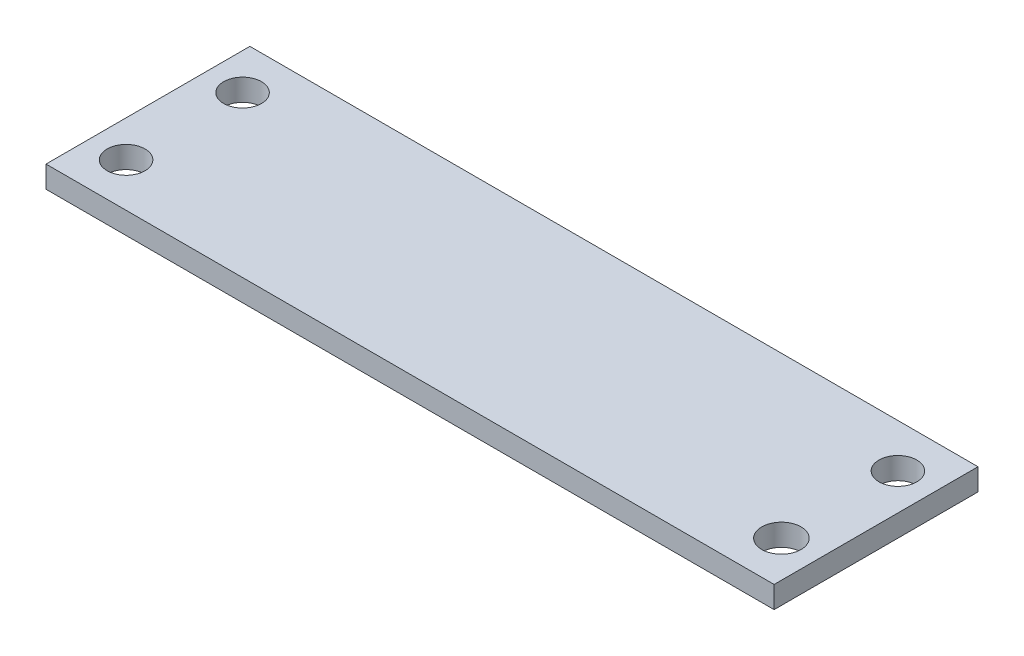
ISO-10303-21;
HEADER;
FILE_DESCRIPTION(('STEP AP214'),'2;1');
FILE_NAME('part.step','',(''),(''),'','','');
FILE_SCHEMA(('AUTOMOTIVE_DESIGN { 1 0 10303 214 1 1 1 1 }'));
ENDSEC;
DATA;
#1=APPLICATION_CONTEXT('core data for automotive mechanical design processes');
#2=APPLICATION_PROTOCOL_DEFINITION('international standard','automotive_design',2000,#1);
#3=PRODUCT_CONTEXT('',#1,'mechanical');
#4=PRODUCT('Part','Part','',(#3));
#5=PRODUCT_RELATED_PRODUCT_CATEGORY('part','',(#4));
#6=PRODUCT_DEFINITION_FORMATION('','',#4);
#7=PRODUCT_DEFINITION_CONTEXT('part definition',#1,'design');
#8=PRODUCT_DEFINITION('design','',#6,#7);
#9=PRODUCT_DEFINITION_SHAPE('','',#8);
#10=(LENGTH_UNIT() NAMED_UNIT(*) SI_UNIT(.MILLI.,.METRE.));
#11=(NAMED_UNIT(*) PLANE_ANGLE_UNIT() SI_UNIT($,.RADIAN.));
#12=(NAMED_UNIT(*) SI_UNIT($,.STERADIAN.) SOLID_ANGLE_UNIT());
#13=UNCERTAINTY_MEASURE_WITH_UNIT(LENGTH_MEASURE(1.E-05),#10,'distance_accuracy_value','');
#14=(GEOMETRIC_REPRESENTATION_CONTEXT(3) GLOBAL_UNCERTAINTY_ASSIGNED_CONTEXT((#13)) GLOBAL_UNIT_ASSIGNED_CONTEXT((#10,
#11,#12)) REPRESENTATION_CONTEXT('',''));
#15=CARTESIAN_POINT('',(0.,0.,0.));
#16=DIRECTION('',(0.,0.,1.));
#17=DIRECTION('',(1.,0.,0.));
#18=AXIS2_PLACEMENT_3D('',#15,#16,#17);
#19=CARTESIAN_POINT('',(0.,1.5,0.));
#20=DIRECTION('',(0.,-1.,0.));
#21=DIRECTION('',(0.,0.,-1.));
#22=AXIS2_PLACEMENT_3D('',#19,#20,#21);
#23=PLANE('',#22);
#24=DIRECTION('',(0.,0.,-1.));
#25=VECTOR('',#24,1.);
#26=CARTESIAN_POINT('',(25.,1.5,-11.));
#27=LINE('',#26,#25);
#28=CARTESIAN_POINT('',(25.,1.5,3.));
#29=VERTEX_POINT('',#28);
#30=CARTESIAN_POINT('',(25.,1.5,-11.));
#31=VERTEX_POINT('',#30);
#32=EDGE_CURVE('E87',#29,#31,#27,.T.);
#33=ORIENTED_EDGE('',*,*,#32,.T.);
#34=DIRECTION('',(-1.,0.,0.));
#35=VECTOR('',#34,1.);
#36=CARTESIAN_POINT('',(0.,1.5,-11.));
#37=LINE('',#36,#35);
#38=CARTESIAN_POINT('',(-25.,1.5,-11.));
#39=VERTEX_POINT('',#38);
#40=EDGE_CURVE('E82',#31,#39,#37,.T.);
#41=ORIENTED_EDGE('',*,*,#40,.T.);
#42=DIRECTION('',(0.,0.,1.));
#43=VECTOR('',#42,1.);
#44=CARTESIAN_POINT('',(-25.,1.5,3.00000000000001));
#45=LINE('',#44,#43);
#46=CARTESIAN_POINT('',(-25.,1.5,3.00000000000001));
#47=VERTEX_POINT('',#46);
#48=EDGE_CURVE('E85',#39,#47,#45,.T.);
#49=ORIENTED_EDGE('',*,*,#48,.T.);
#50=DIRECTION('',(1.,0.,0.));
#51=VECTOR('',#50,1.);
#52=CARTESIAN_POINT('',(25.,1.5,3.));
#53=LINE('',#52,#51);
#54=EDGE_CURVE('E52',#47,#29,#53,.T.);
#55=ORIENTED_EDGE('',*,*,#54,.T.);
#56=EDGE_LOOP('',(#33,#41,#49,#55));
#57=FACE_BOUND('',#56,.T.);
#58=CARTESIAN_POINT('',(22.5,1.5,0.));
#59=DIRECTION('',(0.,1.,0.));
#60=DIRECTION('',(0.,0.,1.));
#61=AXIS2_PLACEMENT_3D('',#58,#59,#60);
#62=CIRCLE('',#61,1.35);
#63=CARTESIAN_POINT('',(22.5,1.5,1.35));
#64=VERTEX_POINT('',#63);
#65=EDGE_CURVE('E102',#64,#64,#62,.T.);
#66=ORIENTED_EDGE('',*,*,#65,.F.);
#67=EDGE_LOOP('',(#66));
#68=FACE_BOUND('',#67,.T.);
#69=CARTESIAN_POINT('',(-22.5,1.5,0.));
#70=DIRECTION('',(0.,1.,0.));
#71=DIRECTION('',(0.,0.,1.));
#72=AXIS2_PLACEMENT_3D('',#69,#70,#71);
#73=CIRCLE('',#72,1.3);
#74=CARTESIAN_POINT('',(-22.5,1.5,1.3));
#75=VERTEX_POINT('',#74);
#76=EDGE_CURVE('E117',#75,#75,#73,.T.);
#77=ORIENTED_EDGE('',*,*,#76,.F.);
#78=EDGE_LOOP('',(#77));
#79=FACE_BOUND('',#78,.T.);
#80=CARTESIAN_POINT('',(-22.5,1.5,-8.));
#81=DIRECTION('',(0.,1.,0.));
#82=DIRECTION('',(0.,0.,1.));
#83=AXIS2_PLACEMENT_3D('',#80,#81,#82);
#84=CIRCLE('',#83,1.3);
#85=CARTESIAN_POINT('',(-22.5,1.5,-6.7));
#86=VERTEX_POINT('',#85);
#87=EDGE_CURVE('E123',#86,#86,#84,.T.);
#88=ORIENTED_EDGE('',*,*,#87,.F.);
#89=EDGE_LOOP('',(#88));
#90=FACE_BOUND('',#89,.T.);
#91=CARTESIAN_POINT('',(22.5,1.5,-8.));
#92=DIRECTION('',(0.,1.,0.));
#93=DIRECTION('',(0.,0.,1.));
#94=AXIS2_PLACEMENT_3D('',#91,#92,#93);
#95=CIRCLE('',#94,1.3);
#96=CARTESIAN_POINT('',(22.5,1.5,-6.7));
#97=VERTEX_POINT('',#96);
#98=EDGE_CURVE('E129',#97,#97,#95,.T.);
#99=ORIENTED_EDGE('',*,*,#98,.F.);
#100=EDGE_LOOP('',(#99));
#101=FACE_BOUND('',#100,.T.);
#102=ADVANCED_FACE('F35',(#57,#68,#79,#90,#101),#23,.F.);
#103=CARTESIAN_POINT('',(0.,0.,0.));
#104=DIRECTION('',(0.,-1.,0.));
#105=DIRECTION('',(0.,0.,-1.));
#106=AXIS2_PLACEMENT_3D('',#103,#104,#105);
#107=PLANE('',#106);
#108=CARTESIAN_POINT('',(-22.5,0.,-8.));
#109=DIRECTION('',(0.,1.,0.));
#110=DIRECTION('',(0.,0.,1.));
#111=AXIS2_PLACEMENT_3D('',#108,#109,#110);
#112=CIRCLE('',#111,1.3);
#113=CARTESIAN_POINT('',(-22.5,0.,-6.7));
#114=VERTEX_POINT('',#113);
#115=EDGE_CURVE('E126',#114,#114,#112,.T.);
#116=ORIENTED_EDGE('',*,*,#115,.T.);
#117=EDGE_LOOP('',(#116));
#118=FACE_BOUND('',#117,.T.);
#119=CARTESIAN_POINT('',(22.5,0.,0.));
#120=DIRECTION('',(0.,1.,0.));
#121=DIRECTION('',(0.,0.,1.));
#122=AXIS2_PLACEMENT_3D('',#119,#120,#121);
#123=CIRCLE('',#122,1.35);
#124=CARTESIAN_POINT('',(22.5,0.,1.35));
#125=VERTEX_POINT('',#124);
#126=EDGE_CURVE('E114',#125,#125,#123,.T.);
#127=ORIENTED_EDGE('',*,*,#126,.T.);
#128=EDGE_LOOP('',(#127));
#129=FACE_BOUND('',#128,.T.);
#130=DIRECTION('',(0.,0.,-1.));
#131=VECTOR('',#130,1.);
#132=CARTESIAN_POINT('',(25.,0.,-11.));
#133=LINE('',#132,#131);
#134=CARTESIAN_POINT('',(25.,0.,3.));
#135=VERTEX_POINT('',#134);
#136=CARTESIAN_POINT('',(25.,0.,-11.));
#137=VERTEX_POINT('',#136);
#138=EDGE_CURVE('E99',#135,#137,#133,.T.);
#139=ORIENTED_EDGE('',*,*,#138,.F.);
#140=DIRECTION('',(1.,0.,0.));
#141=VECTOR('',#140,1.);
#142=CARTESIAN_POINT('',(25.,0.,3.));
#143=LINE('',#142,#141);
#144=CARTESIAN_POINT('',(-25.,0.,3.00000000000001));
#145=VERTEX_POINT('',#144);
#146=EDGE_CURVE('E75',#145,#135,#143,.T.);
#147=ORIENTED_EDGE('',*,*,#146,.F.);
#148=DIRECTION('',(0.,0.,1.));
#149=VECTOR('',#148,1.);
#150=CARTESIAN_POINT('',(-25.,0.,3.00000000000001));
#151=LINE('',#150,#149);
#152=CARTESIAN_POINT('',(-25.,0.,-11.));
#153=VERTEX_POINT('',#152);
#154=EDGE_CURVE('E69',#153,#145,#151,.T.);
#155=ORIENTED_EDGE('',*,*,#154,.F.);
#156=DIRECTION('',(-1.,0.,0.));
#157=VECTOR('',#156,1.);
#158=CARTESIAN_POINT('',(-25.,0.,-11.));
#159=LINE('',#158,#157);
#160=EDGE_CURVE('E91',#137,#153,#159,.T.);
#161=ORIENTED_EDGE('',*,*,#160,.F.);
#162=EDGE_LOOP('',(#139,#147,#155,#161));
#163=FACE_BOUND('',#162,.T.);
#164=CARTESIAN_POINT('',(-22.5,0.,0.));
#165=DIRECTION('',(0.,1.,0.));
#166=DIRECTION('',(0.,0.,1.));
#167=AXIS2_PLACEMENT_3D('',#164,#165,#166);
#168=CIRCLE('',#167,1.3);
#169=CARTESIAN_POINT('',(-22.5,0.,1.3));
#170=VERTEX_POINT('',#169);
#171=EDGE_CURVE('E120',#170,#170,#168,.T.);
#172=ORIENTED_EDGE('',*,*,#171,.T.);
#173=EDGE_LOOP('',(#172));
#174=FACE_BOUND('',#173,.T.);
#175=CARTESIAN_POINT('',(22.5,0.,-8.));
#176=DIRECTION('',(0.,1.,0.));
#177=DIRECTION('',(0.,0.,1.));
#178=AXIS2_PLACEMENT_3D('',#175,#176,#177);
#179=CIRCLE('',#178,1.3);
#180=CARTESIAN_POINT('',(22.5,0.,-6.7));
#181=VERTEX_POINT('',#180);
#182=EDGE_CURVE('E132',#181,#181,#179,.T.);
#183=ORIENTED_EDGE('',*,*,#182,.T.);
#184=EDGE_LOOP('',(#183));
#185=FACE_BOUND('',#184,.T.);
#186=ADVANCED_FACE('F110',(#118,#129,#163,#174,#185),#107,.T.);
#187=CARTESIAN_POINT('',(25.,1.5,-11.));
#188=DIRECTION('',(-1.,0.,0.));
#189=DIRECTION('',(0.,0.,1.));
#190=AXIS2_PLACEMENT_3D('',#187,#188,#189);
#191=PLANE('',#190);
#192=ORIENTED_EDGE('',*,*,#138,.T.);
#193=DIRECTION('',(0.,-1.,0.));
#194=VECTOR('',#193,1.);
#195=CARTESIAN_POINT('',(25.,1.5,-11.));
#196=LINE('',#195,#194);
#197=EDGE_CURVE('E11',#31,#137,#196,.T.);
#198=ORIENTED_EDGE('',*,*,#197,.F.);
#199=ORIENTED_EDGE('',*,*,#32,.F.);
#200=DIRECTION('',(0.,-1.,0.));
#201=VECTOR('',#200,1.);
#202=CARTESIAN_POINT('',(25.,1.5,3.));
#203=LINE('',#202,#201);
#204=EDGE_CURVE('E95',#29,#135,#203,.T.);
#205=ORIENTED_EDGE('',*,*,#204,.T.);
#206=EDGE_LOOP('',(#192,#198,#199,#205));
#207=FACE_BOUND('',#206,.T.);
#208=ADVANCED_FACE('F37',(#207),#191,.F.);
#209=CARTESIAN_POINT('',(-25.,1.5,-11.));
#210=DIRECTION('',(0.,0.,1.));
#211=DIRECTION('',(1.,0.,0.));
#212=AXIS2_PLACEMENT_3D('',#209,#210,#211);
#213=PLANE('',#212);
#214=ORIENTED_EDGE('',*,*,#160,.T.);
#215=DIRECTION('',(0.,-1.,0.));
#216=VECTOR('',#215,1.);
#217=CARTESIAN_POINT('',(-25.,1.5,-11.));
#218=LINE('',#217,#216);
#219=EDGE_CURVE('E44',#39,#153,#218,.T.);
#220=ORIENTED_EDGE('',*,*,#219,.F.);
#221=ORIENTED_EDGE('',*,*,#40,.F.);
#222=ORIENTED_EDGE('',*,*,#197,.T.);
#223=EDGE_LOOP('',(#214,#220,#221,#222));
#224=FACE_BOUND('',#223,.T.);
#225=ADVANCED_FACE('F90',(#224),#213,.F.);
#226=CARTESIAN_POINT('',(-25.,1.5,3.00000000000001));
#227=DIRECTION('',(1.,0.,0.));
#228=DIRECTION('',(0.,0.,-1.));
#229=AXIS2_PLACEMENT_3D('',#226,#227,#228);
#230=PLANE('',#229);
#231=ORIENTED_EDGE('',*,*,#154,.T.);
#232=DIRECTION('',(0.,-1.,0.));
#233=VECTOR('',#232,1.);
#234=CARTESIAN_POINT('',(-25.,1.5,3.00000000000001));
#235=LINE('',#234,#233);
#236=EDGE_CURVE('E92',#47,#145,#235,.T.);
#237=ORIENTED_EDGE('',*,*,#236,.F.);
#238=ORIENTED_EDGE('',*,*,#48,.F.);
#239=ORIENTED_EDGE('',*,*,#219,.T.);
#240=EDGE_LOOP('',(#231,#237,#238,#239));
#241=FACE_BOUND('',#240,.T.);
#242=ADVANCED_FACE('F93',(#241),#230,.F.);
#243=CARTESIAN_POINT('',(25.,1.5,3.));
#244=DIRECTION('',(0.,0.,-1.));
#245=DIRECTION('',(-1.,0.,0.));
#246=AXIS2_PLACEMENT_3D('',#243,#244,#245);
#247=PLANE('',#246);
#248=ORIENTED_EDGE('',*,*,#146,.T.);
#249=ORIENTED_EDGE('',*,*,#204,.F.);
#250=ORIENTED_EDGE('',*,*,#54,.F.);
#251=ORIENTED_EDGE('',*,*,#236,.T.);
#252=EDGE_LOOP('',(#248,#249,#250,#251));
#253=FACE_BOUND('',#252,.T.);
#254=ADVANCED_FACE('F107',(#253),#247,.F.);
#255=CARTESIAN_POINT('',(22.5,1.5,0.));
#256=DIRECTION('',(0.,-1.,0.));
#257=DIRECTION('',(0.,0.,-1.));
#258=AXIS2_PLACEMENT_3D('',#255,#256,#257);
#259=CYLINDRICAL_SURFACE('',#258,1.35);
#260=ORIENTED_EDGE('',*,*,#65,.T.);
#261=EDGE_LOOP('',(#260));
#262=FACE_BOUND('',#261,.T.);
#263=ORIENTED_EDGE('',*,*,#126,.F.);
#264=EDGE_LOOP('',(#263));
#265=FACE_BOUND('',#264,.T.);
#266=ADVANCED_FACE('F149',(#262,#265),#259,.F.);
#267=CARTESIAN_POINT('',(-22.5,1.5,0.));
#268=DIRECTION('',(0.,-1.,0.));
#269=DIRECTION('',(0.,0.,-1.));
#270=AXIS2_PLACEMENT_3D('',#267,#268,#269);
#271=CYLINDRICAL_SURFACE('',#270,1.3);
#272=ORIENTED_EDGE('',*,*,#76,.T.);
#273=EDGE_LOOP('',(#272));
#274=FACE_BOUND('',#273,.T.);
#275=ORIENTED_EDGE('',*,*,#171,.F.);
#276=EDGE_LOOP('',(#275));
#277=FACE_BOUND('',#276,.T.);
#278=ADVANCED_FACE('F198',(#274,#277),#271,.F.);
#279=CARTESIAN_POINT('',(-22.5,1.5,-8.));
#280=DIRECTION('',(0.,-1.,0.));
#281=DIRECTION('',(0.,0.,-1.));
#282=AXIS2_PLACEMENT_3D('',#279,#280,#281);
#283=CYLINDRICAL_SURFACE('',#282,1.3);
#284=ORIENTED_EDGE('',*,*,#87,.T.);
#285=EDGE_LOOP('',(#284));
#286=FACE_BOUND('',#285,.T.);
#287=ORIENTED_EDGE('',*,*,#115,.F.);
#288=EDGE_LOOP('',(#287));
#289=FACE_BOUND('',#288,.T.);
#290=ADVANCED_FACE('F206',(#286,#289),#283,.F.);
#291=CARTESIAN_POINT('',(22.5,1.5,-8.));
#292=DIRECTION('',(0.,-1.,0.));
#293=DIRECTION('',(0.,0.,-1.));
#294=AXIS2_PLACEMENT_3D('',#291,#292,#293);
#295=CYLINDRICAL_SURFACE('',#294,1.3);
#296=ORIENTED_EDGE('',*,*,#98,.T.);
#297=EDGE_LOOP('',(#296));
#298=FACE_BOUND('',#297,.T.);
#299=ORIENTED_EDGE('',*,*,#182,.F.);
#300=EDGE_LOOP('',(#299));
#301=FACE_BOUND('',#300,.T.);
#302=ADVANCED_FACE('F138',(#298,#301),#295,.F.);
#303=CLOSED_SHELL('',(#102,#186,#208,#225,#242,#254,#266,#278,#290,#302));
#304=MANIFOLD_SOLID_BREP('B2',#303);
#305=ADVANCED_BREP_SHAPE_REPRESENTATION('',(#18,#304),#14);
#306=SHAPE_DEFINITION_REPRESENTATION(#9,#305);
ENDSEC;
END-ISO-10303-21;
